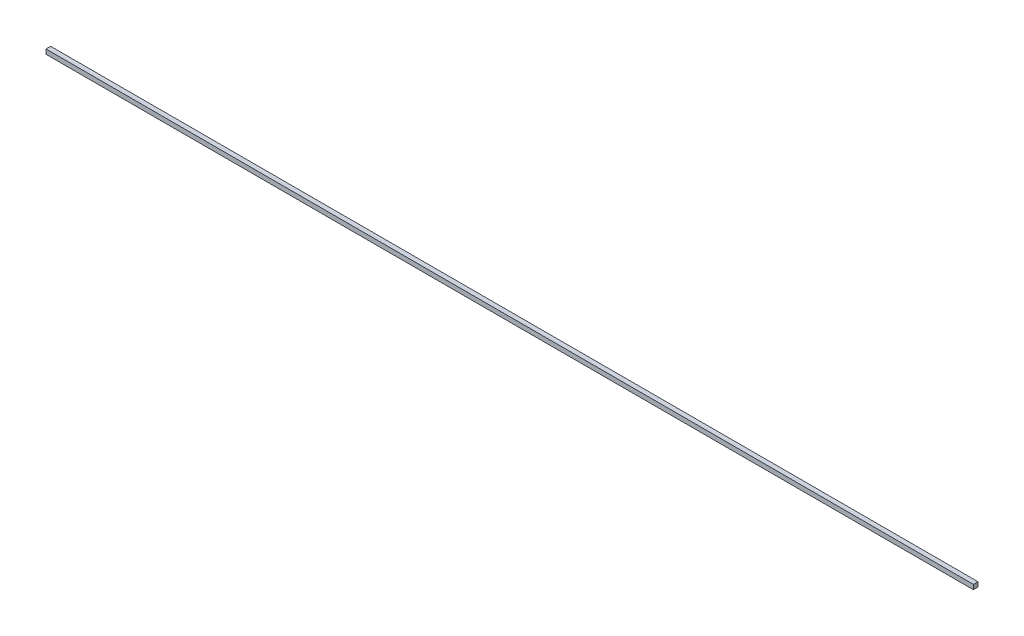
ISO-10303-21;
HEADER;
FILE_DESCRIPTION(('STEP AP214'),'2;1');
FILE_NAME('part.step','',(''),(''),'','','');
FILE_SCHEMA(('AUTOMOTIVE_DESIGN { 1 0 10303 214 1 1 1 1 }'));
ENDSEC;
DATA;
#1=APPLICATION_CONTEXT('core data for automotive mechanical design processes');
#2=APPLICATION_PROTOCOL_DEFINITION('international standard','automotive_design',2000,#1);
#3=PRODUCT_CONTEXT('',#1,'mechanical');
#4=PRODUCT('Part','Part','',(#3));
#5=PRODUCT_RELATED_PRODUCT_CATEGORY('part','',(#4));
#6=PRODUCT_DEFINITION_FORMATION('','',#4);
#7=PRODUCT_DEFINITION_CONTEXT('part definition',#1,'design');
#8=PRODUCT_DEFINITION('design','',#6,#7);
#9=PRODUCT_DEFINITION_SHAPE('','',#8);
#10=(LENGTH_UNIT() NAMED_UNIT(*) SI_UNIT(.MILLI.,.METRE.));
#11=(NAMED_UNIT(*) PLANE_ANGLE_UNIT() SI_UNIT($,.RADIAN.));
#12=(NAMED_UNIT(*) SI_UNIT($,.STERADIAN.) SOLID_ANGLE_UNIT());
#13=UNCERTAINTY_MEASURE_WITH_UNIT(LENGTH_MEASURE(1.E-05),#10,'distance_accuracy_value','');
#14=(GEOMETRIC_REPRESENTATION_CONTEXT(3) GLOBAL_UNCERTAINTY_ASSIGNED_CONTEXT((#13)) GLOBAL_UNIT_ASSIGNED_CONTEXT((#10,
#11,#12)) REPRESENTATION_CONTEXT('',''));
#15=CARTESIAN_POINT('',(0.,0.,0.));
#16=DIRECTION('',(0.,0.,1.));
#17=DIRECTION('',(1.,0.,0.));
#18=AXIS2_PLACEMENT_3D('',#15,#16,#17);
#19=CARTESIAN_POINT('',(0.,0.,3.));
#20=DIRECTION('',(0.,0.,1.));
#21=DIRECTION('',(1.,0.,0.));
#22=AXIS2_PLACEMENT_3D('',#19,#20,#21);
#23=PLANE('',#22);
#24=DIRECTION('',(0.,1.,0.));
#25=VECTOR('',#24,1.);
#26=CARTESIAN_POINT('',(-300.,0.,3.));
#27=LINE('',#26,#25);
#28=CARTESIAN_POINT('',(-300.,47.,3.));
#29=VERTEX_POINT('',#28);
#30=CARTESIAN_POINT('',(-300.,50.,3.));
#31=VERTEX_POINT('',#30);
#32=EDGE_CURVE('E78',#29,#31,#27,.T.);
#33=ORIENTED_EDGE('',*,*,#32,.F.);
#34=DIRECTION('',(1.,0.,0.));
#35=VECTOR('',#34,1.);
#36=CARTESIAN_POINT('',(300.,47.,3.));
#37=LINE('',#36,#35);
#38=CARTESIAN_POINT('',(300.,47.,3.));
#39=VERTEX_POINT('',#38);
#40=EDGE_CURVE('E89',#29,#39,#37,.T.);
#41=ORIENTED_EDGE('',*,*,#40,.T.);
#42=DIRECTION('',(0.,1.,0.));
#43=VECTOR('',#42,1.);
#44=CARTESIAN_POINT('',(300.,1.71683972880179E-13,3.));
#45=LINE('',#44,#43);
#46=CARTESIAN_POINT('',(300.,50.,3.));
#47=VERTEX_POINT('',#46);
#48=EDGE_CURVE('E85',#39,#47,#45,.T.);
#49=ORIENTED_EDGE('',*,*,#48,.T.);
#50=DIRECTION('',(-1.,0.,0.));
#51=VECTOR('',#50,1.);
#52=CARTESIAN_POINT('',(-300.,50.,3.));
#53=LINE('',#52,#51);
#54=EDGE_CURVE('E73',#47,#31,#53,.T.);
#55=ORIENTED_EDGE('',*,*,#54,.T.);
#56=EDGE_LOOP('',(#33,#41,#49,#55));
#57=FACE_BOUND('',#56,.T.);
#58=ADVANCED_FACE('F32',(#57),#23,.T.);
#59=CARTESIAN_POINT('',(300.,47.,3.));
#60=DIRECTION('',(0.,1.,0.));
#61=DIRECTION('',(0.,0.,1.));
#62=AXIS2_PLACEMENT_3D('',#59,#60,#61);
#63=PLANE('',#62);
#64=ORIENTED_EDGE('',*,*,#40,.F.);
#65=DIRECTION('',(0.,0.,1.));
#66=VECTOR('',#65,1.);
#67=CARTESIAN_POINT('',(-300.,47.,3.));
#68=LINE('',#67,#66);
#69=CARTESIAN_POINT('',(-300.,47.,0.));
#70=VERTEX_POINT('',#69);
#71=EDGE_CURVE('E11',#70,#29,#68,.T.);
#72=ORIENTED_EDGE('',*,*,#71,.F.);
#73=DIRECTION('',(1.,0.,0.));
#74=VECTOR('',#73,1.);
#75=CARTESIAN_POINT('',(-300.,47.,0.));
#76=LINE('',#75,#74);
#77=CARTESIAN_POINT('',(300.,47.,0.));
#78=VERTEX_POINT('',#77);
#79=EDGE_CURVE('E54',#70,#78,#76,.T.);
#80=ORIENTED_EDGE('',*,*,#79,.T.);
#81=DIRECTION('',(0.,0.,1.));
#82=VECTOR('',#81,1.);
#83=CARTESIAN_POINT('',(300.,47.,3.));
#84=LINE('',#83,#82);
#85=EDGE_CURVE('E84',#78,#39,#84,.T.);
#86=ORIENTED_EDGE('',*,*,#85,.T.);
#87=EDGE_LOOP('',(#64,#72,#80,#86));
#88=FACE_BOUND('',#87,.T.);
#89=ADVANCED_FACE('F34',(#88),#63,.F.);
#90=CARTESIAN_POINT('',(-300.,50.,60.));
#91=DIRECTION('',(0.,-1.,0.));
#92=DIRECTION('',(0.,0.,-1.));
#93=AXIS2_PLACEMENT_3D('',#90,#91,#92);
#94=PLANE('',#93);
#95=ORIENTED_EDGE('',*,*,#54,.F.);
#96=DIRECTION('',(0.,0.,-1.));
#97=VECTOR('',#96,1.);
#98=CARTESIAN_POINT('',(300.,50.,60.));
#99=LINE('',#98,#97);
#100=CARTESIAN_POINT('',(300.,50.,0.));
#101=VERTEX_POINT('',#100);
#102=EDGE_CURVE('E95',#47,#101,#99,.T.);
#103=ORIENTED_EDGE('',*,*,#102,.T.);
#104=DIRECTION('',(-1.,0.,0.));
#105=VECTOR('',#104,1.);
#106=CARTESIAN_POINT('',(-300.,50.,0.));
#107=LINE('',#106,#105);
#108=CARTESIAN_POINT('',(-300.,50.,0.));
#109=VERTEX_POINT('',#108);
#110=EDGE_CURVE('E75',#101,#109,#107,.T.);
#111=ORIENTED_EDGE('',*,*,#110,.T.);
#112=DIRECTION('',(0.,0.,-1.));
#113=VECTOR('',#112,1.);
#114=CARTESIAN_POINT('',(-300.,50.,60.));
#115=LINE('',#114,#113);
#116=EDGE_CURVE('E40',#31,#109,#115,.T.);
#117=ORIENTED_EDGE('',*,*,#116,.F.);
#118=EDGE_LOOP('',(#95,#103,#111,#117));
#119=FACE_BOUND('',#118,.T.);
#120=ADVANCED_FACE('F71',(#119),#94,.F.);
#121=CARTESIAN_POINT('',(-300.,0.,0.));
#122=DIRECTION('',(0.,0.,1.));
#123=DIRECTION('',(1.,0.,0.));
#124=AXIS2_PLACEMENT_3D('',#121,#122,#123);
#125=PLANE('',#124);
#126=DIRECTION('',(0.,-1.,0.));
#127=VECTOR('',#126,1.);
#128=CARTESIAN_POINT('',(-300.,0.,0.));
#129=LINE('',#128,#127);
#130=EDGE_CURVE('E76',#109,#70,#129,.T.);
#131=ORIENTED_EDGE('',*,*,#130,.F.);
#132=ORIENTED_EDGE('',*,*,#110,.F.);
#133=DIRECTION('',(0.,-1.,0.));
#134=VECTOR('',#133,1.);
#135=CARTESIAN_POINT('',(300.,3.43367945760358E-13,0.));
#136=LINE('',#135,#134);
#137=EDGE_CURVE('E97',#101,#78,#136,.T.);
#138=ORIENTED_EDGE('',*,*,#137,.T.);
#139=ORIENTED_EDGE('',*,*,#79,.F.);
#140=EDGE_LOOP('',(#131,#132,#138,#139));
#141=FACE_BOUND('',#140,.T.);
#142=ADVANCED_FACE('F106',(#141),#125,.F.);
#143=CARTESIAN_POINT('',(-300.,0.,0.));
#144=DIRECTION('',(-1.,0.,0.));
#145=DIRECTION('',(0.,0.,1.));
#146=AXIS2_PLACEMENT_3D('',#143,#144,#145);
#147=PLANE('',#146);
#148=ORIENTED_EDGE('',*,*,#71,.T.);
#149=ORIENTED_EDGE('',*,*,#32,.T.);
#150=ORIENTED_EDGE('',*,*,#116,.T.);
#151=ORIENTED_EDGE('',*,*,#130,.T.);
#152=EDGE_LOOP('',(#148,#149,#150,#151));
#153=FACE_BOUND('',#152,.T.);
#154=ADVANCED_FACE('F79',(#153),#147,.T.);
#155=CARTESIAN_POINT('',(300.,1.71683972880179E-13,0.));
#156=DIRECTION('',(-1.,0.,0.));
#157=DIRECTION('',(0.,-1.,0.));
#158=AXIS2_PLACEMENT_3D('',#155,#156,#157);
#159=PLANE('',#158);
#160=ORIENTED_EDGE('',*,*,#48,.F.);
#161=ORIENTED_EDGE('',*,*,#85,.F.);
#162=ORIENTED_EDGE('',*,*,#137,.F.);
#163=ORIENTED_EDGE('',*,*,#102,.F.);
#164=EDGE_LOOP('',(#160,#161,#162,#163));
#165=FACE_BOUND('',#164,.T.);
#166=ADVANCED_FACE('F105',(#165),#159,.F.);
#167=CLOSED_SHELL('',(#58,#89,#120,#142,#154,#166));
#168=MANIFOLD_SOLID_BREP('B2',#167);
#169=ADVANCED_BREP_SHAPE_REPRESENTATION('',(#18,#168),#14);
#170=SHAPE_DEFINITION_REPRESENTATION(#9,#169);
ENDSEC;
END-ISO-10303-21;
